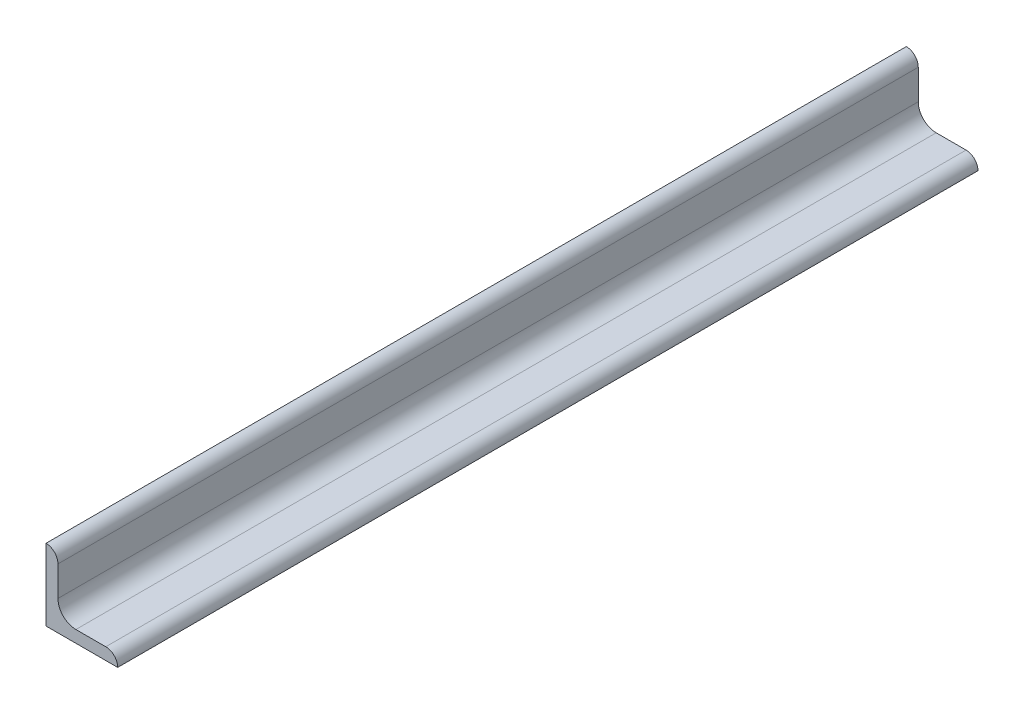
ISO-10303-21;
HEADER;
FILE_DESCRIPTION(('STEP AP214'),'2;1');
FILE_NAME('part.step','',(''),(''),'','','');
FILE_SCHEMA(('AUTOMOTIVE_DESIGN { 1 0 10303 214 1 1 1 1 }'));
ENDSEC;
DATA;
#1=APPLICATION_CONTEXT('core data for automotive mechanical design processes');
#2=APPLICATION_PROTOCOL_DEFINITION('international standard','automotive_design',2000,#1);
#3=PRODUCT_CONTEXT('',#1,'mechanical');
#4=PRODUCT('Part','Part','',(#3));
#5=PRODUCT_RELATED_PRODUCT_CATEGORY('part','',(#4));
#6=PRODUCT_DEFINITION_FORMATION('','',#4);
#7=PRODUCT_DEFINITION_CONTEXT('part definition',#1,'design');
#8=PRODUCT_DEFINITION('design','',#6,#7);
#9=PRODUCT_DEFINITION_SHAPE('','',#8);
#10=(LENGTH_UNIT() NAMED_UNIT(*) SI_UNIT(.MILLI.,.METRE.));
#11=(NAMED_UNIT(*) PLANE_ANGLE_UNIT() SI_UNIT($,.RADIAN.));
#12=(NAMED_UNIT(*) SI_UNIT($,.STERADIAN.) SOLID_ANGLE_UNIT());
#13=UNCERTAINTY_MEASURE_WITH_UNIT(LENGTH_MEASURE(1.E-05),#10,'distance_accuracy_value','');
#14=(GEOMETRIC_REPRESENTATION_CONTEXT(3) GLOBAL_UNCERTAINTY_ASSIGNED_CONTEXT((#13)) GLOBAL_UNIT_ASSIGNED_CONTEXT((#10,
#11,#12)) REPRESENTATION_CONTEXT('',''));
#15=CARTESIAN_POINT('',(0.,0.,0.));
#16=DIRECTION('',(0.,0.,1.));
#17=DIRECTION('',(1.,0.,0.));
#18=AXIS2_PLACEMENT_3D('',#15,#16,#17);
#19=CARTESIAN_POINT('',(19.05,0.,114.3));
#20=DIRECTION('',(0.,1.,0.));
#21=DIRECTION('',(-1.,0.,0.));
#22=AXIS2_PLACEMENT_3D('',#19,#20,#21);
#23=PLANE('',#22);
#24=DIRECTION('',(1.,0.,0.));
#25=VECTOR('',#24,1.);
#26=CARTESIAN_POINT('',(19.05,0.,-114.3));
#27=LINE('',#26,#25);
#28=CARTESIAN_POINT('',(0.,0.,-114.3));
#29=VERTEX_POINT('',#28);
#30=CARTESIAN_POINT('',(19.05,0.,-114.3));
#31=VERTEX_POINT('',#30);
#32=EDGE_CURVE('E134',#29,#31,#27,.T.);
#33=ORIENTED_EDGE('',*,*,#32,.T.);
#34=DIRECTION('',(0.,0.,-1.));
#35=VECTOR('',#34,1.);
#36=CARTESIAN_POINT('',(19.05,0.,114.3));
#37=LINE('',#36,#35);
#38=CARTESIAN_POINT('',(19.05,0.,114.3));
#39=VERTEX_POINT('',#38);
#40=EDGE_CURVE('E11',#39,#31,#37,.T.);
#41=ORIENTED_EDGE('',*,*,#40,.F.);
#42=DIRECTION('',(1.,0.,0.));
#43=VECTOR('',#42,1.);
#44=CARTESIAN_POINT('',(19.05,0.,114.3));
#45=LINE('',#44,#43);
#46=CARTESIAN_POINT('',(0.,0.,114.3));
#47=VERTEX_POINT('',#46);
#48=EDGE_CURVE('E150',#47,#39,#45,.T.);
#49=ORIENTED_EDGE('',*,*,#48,.F.);
#50=DIRECTION('',(0.,0.,-1.));
#51=VECTOR('',#50,1.);
#52=CARTESIAN_POINT('',(0.,0.,114.3));
#53=LINE('',#52,#51);
#54=EDGE_CURVE('E130',#47,#29,#53,.T.);
#55=ORIENTED_EDGE('',*,*,#54,.T.);
#56=EDGE_LOOP('',(#33,#41,#49,#55));
#57=FACE_BOUND('',#56,.T.);
#58=ADVANCED_FACE('F32',(#57),#23,.F.);
#59=CARTESIAN_POINT('',(19.05,0.00507999999999611,114.3));
#60=DIRECTION('',(-1.,0.,0.));
#61=DIRECTION('',(0.,0.,1.));
#62=AXIS2_PLACEMENT_3D('',#59,#60,#61);
#63=PLANE('',#62);
#64=DIRECTION('',(0.,1.,0.));
#65=VECTOR('',#64,1.);
#66=CARTESIAN_POINT('',(19.05,0.00507999999999611,-114.3));
#67=LINE('',#66,#65);
#68=CARTESIAN_POINT('',(19.05,0.00507999999999611,-114.3));
#69=VERTEX_POINT('',#68);
#70=EDGE_CURVE('E137',#31,#69,#67,.T.);
#71=ORIENTED_EDGE('',*,*,#70,.T.);
#72=DIRECTION('',(0.,0.,-1.));
#73=VECTOR('',#72,1.);
#74=CARTESIAN_POINT('',(19.05,0.00507999999999611,114.3));
#75=LINE('',#74,#73);
#76=CARTESIAN_POINT('',(19.05,0.00507999999999611,114.3));
#77=VERTEX_POINT('',#76);
#78=EDGE_CURVE('E40',#77,#69,#75,.T.);
#79=ORIENTED_EDGE('',*,*,#78,.F.);
#80=DIRECTION('',(0.,1.,0.));
#81=VECTOR('',#80,1.);
#82=CARTESIAN_POINT('',(19.05,0.00507999999999611,114.3));
#83=LINE('',#82,#81);
#84=EDGE_CURVE('E94',#39,#77,#83,.T.);
#85=ORIENTED_EDGE('',*,*,#84,.F.);
#86=ORIENTED_EDGE('',*,*,#40,.T.);
#87=EDGE_LOOP('',(#71,#79,#85,#86));
#88=FACE_BOUND('',#87,.T.);
#89=ADVANCED_FACE('F193',(#88),#63,.F.);
#90=CARTESIAN_POINT('',(15.88008,0.00507999999999573,114.3));
#91=DIRECTION('',(0.,0.,-1.));
#92=DIRECTION('',(-1.,0.,0.));
#93=AXIS2_PLACEMENT_3D('',#90,#91,#92);
#94=CYLINDRICAL_SURFACE('',#93,3.16992);
#95=CARTESIAN_POINT('',(15.88008,0.00507999999999573,-114.3));
#96=DIRECTION('',(0.,0.,1.));
#97=DIRECTION('',(1.,0.,0.));
#98=AXIS2_PLACEMENT_3D('',#95,#96,#97);
#99=CIRCLE('',#98,3.16992);
#100=CARTESIAN_POINT('',(15.88008,3.17499999999999,-114.3));
#101=VERTEX_POINT('',#100);
#102=EDGE_CURVE('E139',#69,#101,#99,.T.);
#103=ORIENTED_EDGE('',*,*,#102,.T.);
#104=DIRECTION('',(0.,0.,-1.));
#105=VECTOR('',#104,1.);
#106=CARTESIAN_POINT('',(15.88008,3.17499999999999,114.3));
#107=LINE('',#106,#105);
#108=CARTESIAN_POINT('',(15.88008,3.17499999999999,114.3));
#109=VERTEX_POINT('',#108);
#110=EDGE_CURVE('E160',#109,#101,#107,.T.);
#111=ORIENTED_EDGE('',*,*,#110,.F.);
#112=CARTESIAN_POINT('',(15.88008,0.00507999999999573,114.3));
#113=DIRECTION('',(0.,0.,1.));
#114=DIRECTION('',(1.,0.,0.));
#115=AXIS2_PLACEMENT_3D('',#112,#113,#114);
#116=CIRCLE('',#115,3.16992);
#117=EDGE_CURVE('E168',#77,#109,#116,.T.);
#118=ORIENTED_EDGE('',*,*,#117,.F.);
#119=ORIENTED_EDGE('',*,*,#78,.T.);
#120=EDGE_LOOP('',(#103,#111,#118,#119));
#121=FACE_BOUND('',#120,.T.);
#122=ADVANCED_FACE('F166',(#121),#94,.T.);
#123=CARTESIAN_POINT('',(7.93749999999999,3.175,114.3));
#124=DIRECTION('',(0.,-1.,0.));
#125=DIRECTION('',(1.,0.,0.));
#126=AXIS2_PLACEMENT_3D('',#123,#124,#125);
#127=PLANE('',#126);
#128=DIRECTION('',(-1.,0.,0.));
#129=VECTOR('',#128,1.);
#130=CARTESIAN_POINT('',(7.93749999999999,3.175,-114.3));
#131=LINE('',#130,#129);
#132=CARTESIAN_POINT('',(7.93749999999999,3.17499999999999,-114.3));
#133=VERTEX_POINT('',#132);
#134=EDGE_CURVE('E141',#101,#133,#131,.T.);
#135=ORIENTED_EDGE('',*,*,#134,.T.);
#136=DIRECTION('',(0.,0.,-1.));
#137=VECTOR('',#136,1.);
#138=CARTESIAN_POINT('',(7.93749999999999,3.17499999999999,114.3));
#139=LINE('',#138,#137);
#140=CARTESIAN_POINT('',(7.93749999999999,3.17499999999999,114.3));
#141=VERTEX_POINT('',#140);
#142=EDGE_CURVE('E157',#141,#133,#139,.T.);
#143=ORIENTED_EDGE('',*,*,#142,.F.);
#144=DIRECTION('',(-1.,0.,0.));
#145=VECTOR('',#144,1.);
#146=CARTESIAN_POINT('',(7.93749999999999,3.175,114.3));
#147=LINE('',#146,#145);
#148=EDGE_CURVE('E184',#109,#141,#147,.T.);
#149=ORIENTED_EDGE('',*,*,#148,.F.);
#150=ORIENTED_EDGE('',*,*,#110,.T.);
#151=EDGE_LOOP('',(#135,#143,#149,#150));
#152=FACE_BOUND('',#151,.T.);
#153=ADVANCED_FACE('F177',(#152),#127,.F.);
#154=CARTESIAN_POINT('',(7.93749999999999,7.93749999999999,114.3));
#155=DIRECTION('',(0.,0.,-1.));
#156=DIRECTION('',(-1.,0.,0.));
#157=AXIS2_PLACEMENT_3D('',#154,#155,#156);
#158=CYLINDRICAL_SURFACE('',#157,4.7625);
#159=CARTESIAN_POINT('',(7.93749999999999,7.93749999999999,-114.3));
#160=DIRECTION('',(0.,0.,-1.));
#161=DIRECTION('',(-1.,0.,0.));
#162=AXIS2_PLACEMENT_3D('',#159,#160,#161);
#163=CIRCLE('',#162,4.7625);
#164=CARTESIAN_POINT('',(3.17499999999999,7.93749999999999,-114.3));
#165=VERTEX_POINT('',#164);
#166=EDGE_CURVE('E143',#133,#165,#163,.T.);
#167=ORIENTED_EDGE('',*,*,#166,.T.);
#168=DIRECTION('',(0.,0.,-1.));
#169=VECTOR('',#168,1.);
#170=CARTESIAN_POINT('',(3.17499999999999,7.93749999999999,114.3));
#171=LINE('',#170,#169);
#172=CARTESIAN_POINT('',(3.17499999999999,7.93749999999999,114.3));
#173=VERTEX_POINT('',#172);
#174=EDGE_CURVE('E154',#173,#165,#171,.T.);
#175=ORIENTED_EDGE('',*,*,#174,.F.);
#176=CARTESIAN_POINT('',(7.93749999999999,7.93749999999999,114.3));
#177=DIRECTION('',(0.,0.,-1.));
#178=DIRECTION('',(-1.,0.,0.));
#179=AXIS2_PLACEMENT_3D('',#176,#177,#178);
#180=CIRCLE('',#179,4.7625);
#181=EDGE_CURVE('E183',#141,#173,#180,.T.);
#182=ORIENTED_EDGE('',*,*,#181,.F.);
#183=ORIENTED_EDGE('',*,*,#142,.T.);
#184=EDGE_LOOP('',(#167,#175,#182,#183));
#185=FACE_BOUND('',#184,.T.);
#186=ADVANCED_FACE('F181',(#185),#158,.F.);
#187=CARTESIAN_POINT('',(3.175,15.88008,114.3));
#188=DIRECTION('',(-1.,0.,0.));
#189=DIRECTION('',(0.,-1.,0.));
#190=AXIS2_PLACEMENT_3D('',#187,#188,#189);
#191=PLANE('',#190);
#192=DIRECTION('',(0.,1.,0.));
#193=VECTOR('',#192,1.);
#194=CARTESIAN_POINT('',(3.175,15.88008,-114.3));
#195=LINE('',#194,#193);
#196=CARTESIAN_POINT('',(3.175,15.88008,-114.3));
#197=VERTEX_POINT('',#196);
#198=EDGE_CURVE('E145',#165,#197,#195,.T.);
#199=ORIENTED_EDGE('',*,*,#198,.T.);
#200=DIRECTION('',(0.,0.,-1.));
#201=VECTOR('',#200,1.);
#202=CARTESIAN_POINT('',(3.175,15.88008,114.3));
#203=LINE('',#202,#201);
#204=CARTESIAN_POINT('',(3.175,15.88008,114.3));
#205=VERTEX_POINT('',#204);
#206=EDGE_CURVE('E125',#205,#197,#203,.T.);
#207=ORIENTED_EDGE('',*,*,#206,.F.);
#208=DIRECTION('',(0.,1.,0.));
#209=VECTOR('',#208,1.);
#210=CARTESIAN_POINT('',(3.175,15.88008,114.3));
#211=LINE('',#210,#209);
#212=EDGE_CURVE('E116',#173,#205,#211,.T.);
#213=ORIENTED_EDGE('',*,*,#212,.F.);
#214=ORIENTED_EDGE('',*,*,#174,.T.);
#215=EDGE_LOOP('',(#199,#207,#213,#214));
#216=FACE_BOUND('',#215,.T.);
#217=ADVANCED_FACE('F205',(#216),#191,.F.);
#218=CARTESIAN_POINT('',(0.00508000000000019,15.88008,114.3));
#219=DIRECTION('',(0.,0.,-1.));
#220=DIRECTION('',(-1.,0.,0.));
#221=AXIS2_PLACEMENT_3D('',#218,#219,#220);
#222=CYLINDRICAL_SURFACE('',#221,3.16992);
#223=CARTESIAN_POINT('',(0.00508000000000019,15.88008,-114.3));
#224=DIRECTION('',(0.,0.,1.));
#225=DIRECTION('',(-1.,0.,0.));
#226=AXIS2_PLACEMENT_3D('',#223,#224,#225);
#227=CIRCLE('',#226,3.16992);
#228=CARTESIAN_POINT('',(0.00508,19.05,-114.3));
#229=VERTEX_POINT('',#228);
#230=EDGE_CURVE('E124',#197,#229,#227,.T.);
#231=ORIENTED_EDGE('',*,*,#230,.T.);
#232=DIRECTION('',(0.,0.,-1.));
#233=VECTOR('',#232,1.);
#234=CARTESIAN_POINT('',(0.00508,19.05,114.3));
#235=LINE('',#234,#233);
#236=CARTESIAN_POINT('',(0.00508,19.05,114.3));
#237=VERTEX_POINT('',#236);
#238=EDGE_CURVE('E121',#237,#229,#235,.T.);
#239=ORIENTED_EDGE('',*,*,#238,.F.);
#240=CARTESIAN_POINT('',(0.00508000000000019,15.88008,114.3));
#241=DIRECTION('',(0.,0.,1.));
#242=DIRECTION('',(-1.,0.,0.));
#243=AXIS2_PLACEMENT_3D('',#240,#241,#242);
#244=CIRCLE('',#243,3.16992);
#245=EDGE_CURVE('E110',#205,#237,#244,.T.);
#246=ORIENTED_EDGE('',*,*,#245,.F.);
#247=ORIENTED_EDGE('',*,*,#206,.T.);
#248=EDGE_LOOP('',(#231,#239,#246,#247));
#249=FACE_BOUND('',#248,.T.);
#250=ADVANCED_FACE('F122',(#249),#222,.T.);
#251=CARTESIAN_POINT('',(0.,19.05,114.3));
#252=DIRECTION('',(0.,-1.,0.));
#253=DIRECTION('',(0.,0.,-1.));
#254=AXIS2_PLACEMENT_3D('',#251,#252,#253);
#255=PLANE('',#254);
#256=DIRECTION('',(-1.,0.,0.));
#257=VECTOR('',#256,1.);
#258=CARTESIAN_POINT('',(0.,19.05,-114.3));
#259=LINE('',#258,#257);
#260=CARTESIAN_POINT('',(0.,19.05,-114.3));
#261=VERTEX_POINT('',#260);
#262=EDGE_CURVE('E80',#229,#261,#259,.T.);
#263=ORIENTED_EDGE('',*,*,#262,.T.);
#264=DIRECTION('',(0.,0.,-1.));
#265=VECTOR('',#264,1.);
#266=CARTESIAN_POINT('',(0.,19.05,114.3));
#267=LINE('',#266,#265);
#268=CARTESIAN_POINT('',(0.,19.05,114.3));
#269=VERTEX_POINT('',#268);
#270=EDGE_CURVE('E126',#269,#261,#267,.T.);
#271=ORIENTED_EDGE('',*,*,#270,.F.);
#272=DIRECTION('',(-1.,0.,0.));
#273=VECTOR('',#272,1.);
#274=CARTESIAN_POINT('',(0.,19.05,114.3));
#275=LINE('',#274,#273);
#276=EDGE_CURVE('E114',#237,#269,#275,.T.);
#277=ORIENTED_EDGE('',*,*,#276,.F.);
#278=ORIENTED_EDGE('',*,*,#238,.T.);
#279=EDGE_LOOP('',(#263,#271,#277,#278));
#280=FACE_BOUND('',#279,.T.);
#281=ADVANCED_FACE('F128',(#280),#255,.F.);
#282=CARTESIAN_POINT('',(0.,0.,114.3));
#283=DIRECTION('',(1.,0.,0.));
#284=DIRECTION('',(0.,0.,-1.));
#285=AXIS2_PLACEMENT_3D('',#282,#283,#284);
#286=PLANE('',#285);
#287=DIRECTION('',(0.,-1.,0.));
#288=VECTOR('',#287,1.);
#289=CARTESIAN_POINT('',(0.,0.,-114.3));
#290=LINE('',#289,#288);
#291=EDGE_CURVE('E86',#261,#29,#290,.T.);
#292=ORIENTED_EDGE('',*,*,#291,.T.);
#293=ORIENTED_EDGE('',*,*,#54,.F.);
#294=DIRECTION('',(0.,-1.,0.));
#295=VECTOR('',#294,1.);
#296=CARTESIAN_POINT('',(0.,0.,114.3));
#297=LINE('',#296,#295);
#298=EDGE_CURVE('E48',#269,#47,#297,.T.);
#299=ORIENTED_EDGE('',*,*,#298,.F.);
#300=ORIENTED_EDGE('',*,*,#270,.T.);
#301=EDGE_LOOP('',(#292,#293,#299,#300));
#302=FACE_BOUND('',#301,.T.);
#303=ADVANCED_FACE('F213',(#302),#286,.F.);
#304=CARTESIAN_POINT('',(0.00508000000000019,15.88008,114.3));
#305=DIRECTION('',(0.,0.,-1.));
#306=DIRECTION('',(-1.,0.,0.));
#307=AXIS2_PLACEMENT_3D('',#304,#305,#306);
#308=PLANE('',#307);
#309=ORIENTED_EDGE('',*,*,#48,.T.);
#310=ORIENTED_EDGE('',*,*,#84,.T.);
#311=ORIENTED_EDGE('',*,*,#117,.T.);
#312=ORIENTED_EDGE('',*,*,#148,.T.);
#313=ORIENTED_EDGE('',*,*,#181,.T.);
#314=ORIENTED_EDGE('',*,*,#212,.T.);
#315=ORIENTED_EDGE('',*,*,#245,.T.);
#316=ORIENTED_EDGE('',*,*,#276,.T.);
#317=ORIENTED_EDGE('',*,*,#298,.T.);
#318=EDGE_LOOP('',(#309,#310,#311,#312,#313,#314,#315,#316,#317));
#319=FACE_BOUND('',#318,.T.);
#320=ADVANCED_FACE('F112',(#319),#308,.F.);
#321=CARTESIAN_POINT('',(0.00508000000000019,15.88008,-114.3));
#322=DIRECTION('',(0.,0.,-1.));
#323=DIRECTION('',(-1.,0.,0.));
#324=AXIS2_PLACEMENT_3D('',#321,#322,#323);
#325=PLANE('',#324);
#326=ORIENTED_EDGE('',*,*,#32,.F.);
#327=ORIENTED_EDGE('',*,*,#291,.F.);
#328=ORIENTED_EDGE('',*,*,#262,.F.);
#329=ORIENTED_EDGE('',*,*,#230,.F.);
#330=ORIENTED_EDGE('',*,*,#198,.F.);
#331=ORIENTED_EDGE('',*,*,#166,.F.);
#332=ORIENTED_EDGE('',*,*,#134,.F.);
#333=ORIENTED_EDGE('',*,*,#102,.F.);
#334=ORIENTED_EDGE('',*,*,#70,.F.);
#335=EDGE_LOOP('',(#326,#327,#328,#329,#330,#331,#332,#333,#334));
#336=FACE_BOUND('',#335,.T.);
#337=ADVANCED_FACE('F172',(#336),#325,.T.);
#338=CLOSED_SHELL('',(#58,#89,#122,#153,#186,#217,#250,#281,#303,#320,#337));
#339=MANIFOLD_SOLID_BREP('B2',#338);
#340=ADVANCED_BREP_SHAPE_REPRESENTATION('',(#18,#339),#14);
#341=SHAPE_DEFINITION_REPRESENTATION(#9,#340);
ENDSEC;
END-ISO-10303-21;
